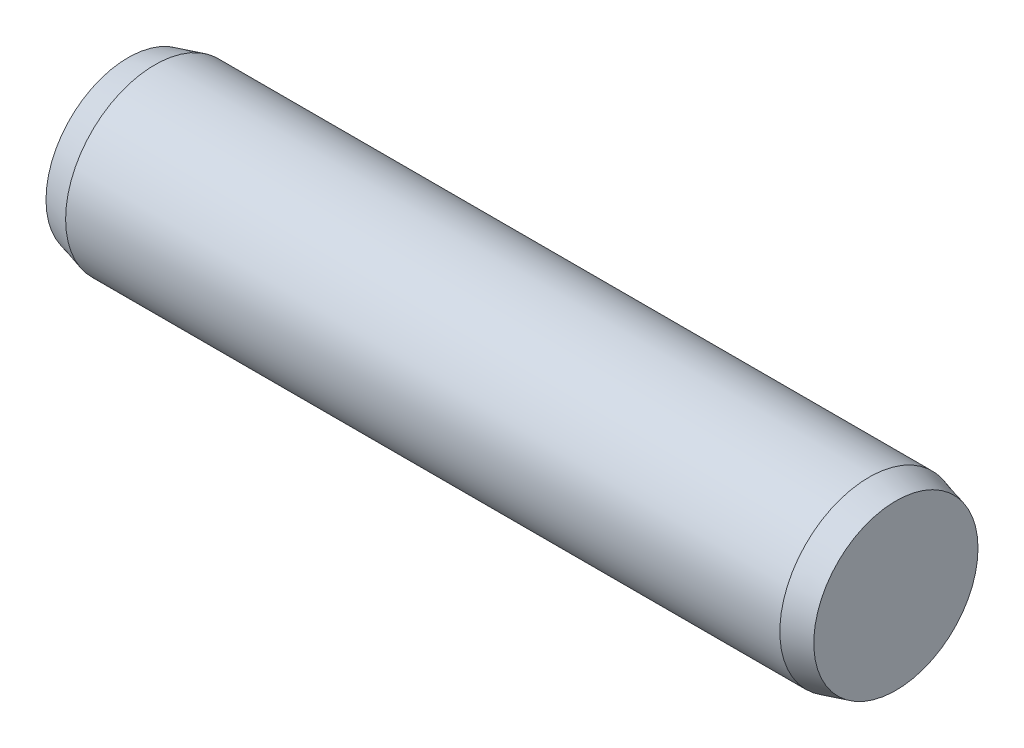
ISO-10303-21;
HEADER;
FILE_DESCRIPTION(('STEP AP214'),'2;1');
FILE_NAME('part.step','',(''),(''),'','','');
FILE_SCHEMA(('AUTOMOTIVE_DESIGN { 1 0 10303 214 1 1 1 1 }'));
ENDSEC;
DATA;
#1=APPLICATION_CONTEXT('core data for automotive mechanical design processes');
#2=APPLICATION_PROTOCOL_DEFINITION('international standard','automotive_design',2000,#1);
#3=PRODUCT_CONTEXT('',#1,'mechanical');
#4=PRODUCT('Part','Part','',(#3));
#5=PRODUCT_RELATED_PRODUCT_CATEGORY('part','',(#4));
#6=PRODUCT_DEFINITION_FORMATION('','',#4);
#7=PRODUCT_DEFINITION_CONTEXT('part definition',#1,'design');
#8=PRODUCT_DEFINITION('design','',#6,#7);
#9=PRODUCT_DEFINITION_SHAPE('','',#8);
#10=(LENGTH_UNIT() NAMED_UNIT(*) SI_UNIT(.MILLI.,.METRE.));
#11=(NAMED_UNIT(*) PLANE_ANGLE_UNIT() SI_UNIT($,.RADIAN.));
#12=(NAMED_UNIT(*) SI_UNIT($,.STERADIAN.) SOLID_ANGLE_UNIT());
#13=UNCERTAINTY_MEASURE_WITH_UNIT(LENGTH_MEASURE(1.E-05),#10,'distance_accuracy_value','');
#14=(GEOMETRIC_REPRESENTATION_CONTEXT(3) GLOBAL_UNCERTAINTY_ASSIGNED_CONTEXT((#13)) GLOBAL_UNIT_ASSIGNED_CONTEXT((#10,
#11,#12)) REPRESENTATION_CONTEXT('',''));
#15=CARTESIAN_POINT('',(0.,0.,0.));
#16=DIRECTION('',(0.,0.,1.));
#17=DIRECTION('',(1.,0.,0.));
#18=AXIS2_PLACEMENT_3D('',#15,#16,#17);
#19=CARTESIAN_POINT('',(-8.,0.,0.));
#20=DIRECTION('',(1.,0.,0.));
#21=DIRECTION('',(0.,0.,-1.));
#22=AXIS2_PLACEMENT_3D('',#19,#20,#21);
#23=CYLINDRICAL_SURFACE('',#22,2.);
#24=CARTESIAN_POINT('',(-8.,0.,0.));
#25=DIRECTION('',(-1.,0.,0.));
#26=DIRECTION('',(0.,0.,1.));
#27=AXIS2_PLACEMENT_3D('',#24,#25,#26);
#28=CIRCLE('',#27,2.);
#29=CARTESIAN_POINT('',(-8.,0.,2.));
#30=VERTEX_POINT('',#29);
#31=EDGE_CURVE('E44',#30,#30,#28,.T.);
#32=ORIENTED_EDGE('',*,*,#31,.F.);
#33=EDGE_LOOP('',(#32));
#34=FACE_BOUND('',#33,.T.);
#35=CARTESIAN_POINT('',(8.,0.,0.));
#36=DIRECTION('',(1.,0.,0.));
#37=DIRECTION('',(0.,0.,-1.));
#38=AXIS2_PLACEMENT_3D('',#35,#36,#37);
#39=CIRCLE('',#38,2.);
#40=CARTESIAN_POINT('',(8.,0.,-2.));
#41=VERTEX_POINT('',#40);
#42=EDGE_CURVE('E10',#41,#41,#39,.T.);
#43=ORIENTED_EDGE('',*,*,#42,.F.);
#44=EDGE_LOOP('',(#43));
#45=FACE_BOUND('',#44,.T.);
#46=ADVANCED_FACE('F30',(#34,#45),#23,.T.);
#47=CARTESIAN_POINT('',(8.,0.,0.));
#48=DIRECTION('',(-1.,0.,0.));
#49=DIRECTION('',(0.,0.,-1.));
#50=AXIS2_PLACEMENT_3D('',#47,#48,#49);
#51=CONICAL_SURFACE('',#50,2.,0.26179938779915);
#52=CARTESIAN_POINT('',(8.6,0.,0.));
#53=DIRECTION('',(1.,0.,0.));
#54=DIRECTION('',(0.,0.,-1.));
#55=AXIS2_PLACEMENT_3D('',#52,#53,#54);
#56=CIRCLE('',#55,1.83923048454133);
#57=CARTESIAN_POINT('',(8.6,0.,-1.83923048454133));
#58=VERTEX_POINT('',#57);
#59=EDGE_CURVE('E36',#58,#58,#56,.T.);
#60=ORIENTED_EDGE('',*,*,#59,.F.);
#61=EDGE_LOOP('',(#60));
#62=FACE_BOUND('',#61,.T.);
#63=ORIENTED_EDGE('',*,*,#42,.T.);
#64=EDGE_LOOP('',(#63));
#65=FACE_BOUND('',#64,.T.);
#66=ADVANCED_FACE('F54',(#62,#65),#51,.T.);
#67=CARTESIAN_POINT('',(8.6,0.,0.));
#68=DIRECTION('',(1.,0.,0.));
#69=DIRECTION('',(0.,0.,-1.));
#70=AXIS2_PLACEMENT_3D('',#67,#68,#69);
#71=PLANE('',#70);
#72=ORIENTED_EDGE('',*,*,#59,.T.);
#73=EDGE_LOOP('',(#72));
#74=FACE_BOUND('',#73,.T.);
#75=ADVANCED_FACE('F58',(#74),#71,.T.);
#76=CARTESIAN_POINT('',(-8.,0.,0.));
#77=DIRECTION('',(1.,0.,0.));
#78=DIRECTION('',(0.,0.,1.));
#79=AXIS2_PLACEMENT_3D('',#76,#77,#78);
#80=CONICAL_SURFACE('',#79,2.,0.26179938779915);
#81=CARTESIAN_POINT('',(-8.6,0.,0.));
#82=DIRECTION('',(-1.,0.,0.));
#83=DIRECTION('',(0.,0.,1.));
#84=AXIS2_PLACEMENT_3D('',#81,#82,#83);
#85=CIRCLE('',#84,1.83923048454133);
#86=CARTESIAN_POINT('',(-8.6,0.,1.83923048454133));
#87=VERTEX_POINT('',#86);
#88=EDGE_CURVE('E40',#87,#87,#85,.T.);
#89=ORIENTED_EDGE('',*,*,#88,.F.);
#90=EDGE_LOOP('',(#89));
#91=FACE_BOUND('',#90,.T.);
#92=ORIENTED_EDGE('',*,*,#31,.T.);
#93=EDGE_LOOP('',(#92));
#94=FACE_BOUND('',#93,.T.);
#95=ADVANCED_FACE('F50',(#91,#94),#80,.T.);
#96=CARTESIAN_POINT('',(-8.6,0.,0.));
#97=DIRECTION('',(-1.,0.,0.));
#98=DIRECTION('',(0.,0.,1.));
#99=AXIS2_PLACEMENT_3D('',#96,#97,#98);
#100=PLANE('',#99);
#101=ORIENTED_EDGE('',*,*,#88,.T.);
#102=EDGE_LOOP('',(#101));
#103=FACE_BOUND('',#102,.T.);
#104=ADVANCED_FACE('F67',(#103),#100,.T.);
#105=CLOSED_SHELL('',(#46,#66,#75,#95,#104));
#106=MANIFOLD_SOLID_BREP('B2',#105);
#107=ADVANCED_BREP_SHAPE_REPRESENTATION('',(#18,#106),#14);
#108=SHAPE_DEFINITION_REPRESENTATION(#9,#107);
ENDSEC;
END-ISO-10303-21;
